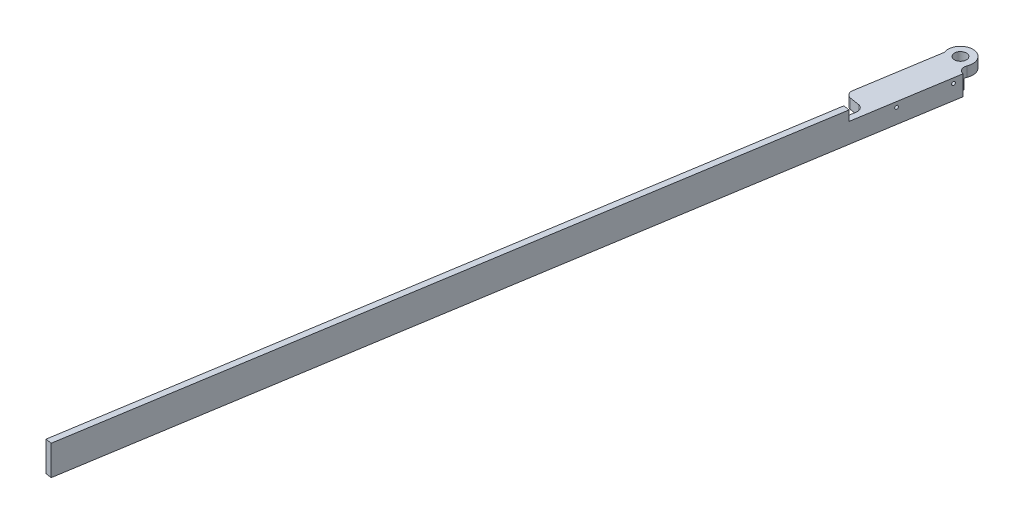
ISO-10303-21;
HEADER;
FILE_DESCRIPTION(('STEP AP214'),'2;1');
FILE_NAME('part.step','',(''),(''),'','','');
FILE_SCHEMA(('AUTOMOTIVE_DESIGN { 1 0 10303 214 1 1 1 1 }'));
ENDSEC;
DATA;
#1=APPLICATION_CONTEXT('core data for automotive mechanical design processes');
#2=APPLICATION_PROTOCOL_DEFINITION('international standard','automotive_design',2000,#1);
#3=PRODUCT_CONTEXT('',#1,'mechanical');
#4=PRODUCT('Part','Part','',(#3));
#5=PRODUCT_RELATED_PRODUCT_CATEGORY('part','',(#4));
#6=PRODUCT_DEFINITION_FORMATION('','',#4);
#7=PRODUCT_DEFINITION_CONTEXT('part definition',#1,'design');
#8=PRODUCT_DEFINITION('design','',#6,#7);
#9=PRODUCT_DEFINITION_SHAPE('','',#8);
#10=(LENGTH_UNIT() NAMED_UNIT(*) SI_UNIT(.MILLI.,.METRE.));
#11=(NAMED_UNIT(*) PLANE_ANGLE_UNIT() SI_UNIT($,.RADIAN.));
#12=(NAMED_UNIT(*) SI_UNIT($,.STERADIAN.) SOLID_ANGLE_UNIT());
#13=UNCERTAINTY_MEASURE_WITH_UNIT(LENGTH_MEASURE(1.E-05),#10,'distance_accuracy_value','');
#14=(GEOMETRIC_REPRESENTATION_CONTEXT(3) GLOBAL_UNCERTAINTY_ASSIGNED_CONTEXT((#13)) GLOBAL_UNIT_ASSIGNED_CONTEXT((#10,
#11,#12)) REPRESENTATION_CONTEXT('',''));
#15=CARTESIAN_POINT('',(0.,0.,0.));
#16=DIRECTION('',(0.,0.,1.));
#17=DIRECTION('',(1.,0.,0.));
#18=AXIS2_PLACEMENT_3D('',#15,#16,#17);
#19=CARTESIAN_POINT('',(-37.8700021982142,13.8264111663313,297.270264957212));
#20=DIRECTION('',(-0.987382807526428,0.,-0.158351480577954));
#21=DIRECTION('',(-0.158351480577954,0.,0.987382807526428));
#22=AXIS2_PLACEMENT_3D('',#19,#20,#21);
#23=PLANE('',#22);
#24=DIRECTION('',(0.158351480577954,0.,-0.987382807526428));
#25=VECTOR('',#24,1.);
#26=CARTESIAN_POINT('',(-13.737236558134,15.7314111663313,146.793125090185));
#27=LINE('',#26,#25);
#28=CARTESIAN_POINT('',(-19.7704279681541,15.7314111663313,184.412410056941));
#29=VERTEX_POINT('',#28);
#30=CARTESIAN_POINT('',(-19.1089041789644,15.7314111663313,180.287553037407));
#31=VERTEX_POINT('',#30);
#32=EDGE_CURVE('E179',#29,#31,#27,.T.);
#33=ORIENTED_EDGE('',*,*,#32,.T.);
#34=DIRECTION('',(0.,-1.,0.));
#35=VECTOR('',#34,1.);
#36=CARTESIAN_POINT('',(-19.1089041789644,13.8264111663313,180.287553037407));
#37=LINE('',#36,#35);
#38=CARTESIAN_POINT('',(-19.1089041789644,11.9214111663313,180.287553037407));
#39=VERTEX_POINT('',#38);
#40=EDGE_CURVE('E259',#31,#39,#37,.T.);
#41=ORIENTED_EDGE('',*,*,#40,.T.);
#42=DIRECTION('',(0.158351480577954,0.,-0.987382807526427));
#43=VECTOR('',#42,1.);
#44=CARTESIAN_POINT('',(-18.7066914182964,11.9214111663313,177.77960070629));
#45=LINE('',#44,#43);
#46=CARTESIAN_POINT('',(-13.4189862964671,11.9214111663313,144.808711457209));
#47=VERTEX_POINT('',#46);
#48=EDGE_CURVE('E67',#39,#47,#45,.T.);
#49=ORIENTED_EDGE('',*,*,#48,.T.);
#50=DIRECTION('',(0.,-1.,0.));
#51=VECTOR('',#50,1.);
#52=CARTESIAN_POINT('',(-13.4189862964671,11.9214111663313,144.808711457209));
#53=LINE('',#52,#51);
#54=CARTESIAN_POINT('',(-13.4189862964671,8.11141116633134,144.808711457209));
#55=VERTEX_POINT('',#54);
#56=EDGE_CURVE('E268',#47,#55,#53,.T.);
#57=ORIENTED_EDGE('',*,*,#56,.T.);
#58=DIRECTION('',(0.158351480577954,0.,-0.987382807526427));
#59=VECTOR('',#58,1.);
#60=CARTESIAN_POINT('',(-62.0027678382944,8.11141116633134,447.74740482424));
#61=LINE('',#60,#59);
#62=CARTESIAN_POINT('',(-62.0027678382944,8.11141116633134,447.74740482424));
#63=VERTEX_POINT('',#62);
#64=EDGE_CURVE('E60',#63,#55,#61,.T.);
#65=ORIENTED_EDGE('',*,*,#64,.F.);
#66=DIRECTION('',(0.,-1.,0.));
#67=VECTOR('',#66,1.);
#68=CARTESIAN_POINT('',(-62.0027678382944,8.11141116633134,447.74740482424));
#69=LINE('',#68,#67);
#70=CARTESIAN_POINT('',(-62.0027678382944,19.5414111663313,447.74740482424));
#71=VERTEX_POINT('',#70);
#72=EDGE_CURVE('E226',#71,#63,#69,.T.);
#73=ORIENTED_EDGE('',*,*,#72,.F.);
#74=DIRECTION('',(-0.158351480577954,0.,0.987382807526427));
#75=VECTOR('',#74,1.);
#76=CARTESIAN_POINT('',(-62.0027678382944,19.5414111663313,447.74740482424));
#77=LINE('',#76,#75);
#78=CARTESIAN_POINT('',(-19.7704279681541,19.5414111663313,184.412410056941));
#79=VERTEX_POINT('',#78);
#80=EDGE_CURVE('E196',#79,#71,#77,.T.);
#81=ORIENTED_EDGE('',*,*,#80,.F.);
#82=DIRECTION('',(0.,-1.,0.));
#83=VECTOR('',#82,1.);
#84=CARTESIAN_POINT('',(-19.7704279681541,19.5414111663313,184.412410056941));
#85=LINE('',#84,#83);
#86=EDGE_CURVE('E175',#79,#29,#85,.T.);
#87=ORIENTED_EDGE('',*,*,#86,.T.);
#88=EDGE_LOOP('',(#33,#41,#49,#57,#65,#73,#81,#87));
#89=FACE_BOUND('',#88,.T.);
#90=ADVANCED_FACE('F44',(#89),#23,.T.);
#91=CARTESIAN_POINT('',(-17.2565982139791,13.8264111663313,168.737707987459));
#92=DIRECTION('',(0.987382807526428,0.,0.158351480577954));
#93=DIRECTION('',(0.158351480577954,0.,-0.987382807526428));
#94=AXIS2_PLACEMENT_3D('',#91,#92,#93);
#95=CIRCLE('',#94,0.634999999999989);
#96=CARTESIAN_POINT('',(-17.1560450238121,13.8264111663313,168.11071990468));
#97=VERTEX_POINT('',#96);
#98=EDGE_CURVE('E202',#97,#97,#95,.T.);
#99=ORIENTED_EDGE('',*,*,#98,.T.);
#100=EDGE_LOOP('',(#99));
#101=FACE_BOUND('',#100,.T.);
#102=CARTESIAN_POINT('',(-17.256598213979,13.8264111663313,168.737707987459));
#103=DIRECTION('',(0.987382807526427,0.,0.158351480577954));
#104=DIRECTION('',(-0.158351480577954,0.,0.987382807526427));
#105=AXIS2_PLACEMENT_3D('',#102,#103,#104);
#106=CIRCLE('',#105,1.27);
#107=CARTESIAN_POINT('',(-17.457704594313,13.8264111663313,169.991684153017));
#108=VERTEX_POINT('',#107);
#109=EDGE_CURVE('E345',#108,#108,#106,.T.);
#110=ORIENTED_EDGE('',*,*,#109,.F.);
#111=EDGE_LOOP('',(#110));
#112=FACE_BOUND('',#111,.T.);
#113=ADVANCED_FACE('F326',(#101,#112),#23,.T.);
#114=CARTESIAN_POINT('',(-14.240002508969,13.8264111663313,149.928065504081));
#115=DIRECTION('',(0.987382807526428,0.,0.158351480577954));
#116=DIRECTION('',(0.158351480577954,0.,-0.987382807526428));
#117=AXIS2_PLACEMENT_3D('',#114,#115,#116);
#118=CIRCLE('',#117,0.634999999999989);
#119=CARTESIAN_POINT('',(-14.139449318802,13.8264111663313,149.301077421302));
#120=VERTEX_POINT('',#119);
#121=EDGE_CURVE('E164',#120,#120,#118,.T.);
#122=ORIENTED_EDGE('',*,*,#121,.T.);
#123=EDGE_LOOP('',(#122));
#124=FACE_BOUND('',#123,.T.);
#125=CARTESIAN_POINT('',(-14.2400025089689,13.8264111663313,149.92806550408));
#126=DIRECTION('',(0.987382807526427,0.,0.158351480577954));
#127=DIRECTION('',(-0.158351480577954,0.,0.987382807526427));
#128=AXIS2_PLACEMENT_3D('',#125,#126,#127);
#129=CIRCLE('',#128,1.27);
#130=CARTESIAN_POINT('',(-14.4411088893029,13.8264111663313,151.182041669639));
#131=VERTEX_POINT('',#130);
#132=EDGE_CURVE('E241',#131,#131,#129,.T.);
#133=ORIENTED_EDGE('',*,*,#132,.F.);
#134=EDGE_LOOP('',(#133));
#135=FACE_BOUND('',#134,.T.);
#136=ADVANCED_FACE('F327',(#124,#135),#23,.T.);
#137=CARTESIAN_POINT('',(-59.6515625278721,19.5414111663313,448.124479287366));
#138=DIRECTION('',(0.,-1.,0.));
#139=DIRECTION('',(-0.987382807526428,0.,-0.158351480577954));
#140=AXIS2_PLACEMENT_3D('',#137,#138,#139);
#141=PLANE('',#140);
#142=DIRECTION('',(-0.158351480577954,0.,0.987382807526427));
#143=VECTOR('',#142,1.);
#144=CARTESIAN_POINT('',(-59.6515625278721,19.5414111663313,448.124479287366));
#145=LINE('',#144,#143);
#146=CARTESIAN_POINT('',(-17.4192226577318,19.5414111663313,184.789484520068));
#147=VERTEX_POINT('',#146);
#148=CARTESIAN_POINT('',(-59.6515625278721,19.5414111663313,448.124479287366));
#149=VERTEX_POINT('',#148);
#150=EDGE_CURVE('E213',#147,#149,#145,.T.);
#151=ORIENTED_EDGE('',*,*,#150,.F.);
#152=DIRECTION('',(0.987382807526427,0.,0.158351480577954));
#153=VECTOR('',#152,1.);
#154=CARTESIAN_POINT('',(-19.7704279681541,19.5414111663313,184.412410056941));
#155=LINE('',#154,#153);
#156=EDGE_CURVE('E184',#79,#147,#155,.T.);
#157=ORIENTED_EDGE('',*,*,#156,.F.);
#158=ORIENTED_EDGE('',*,*,#80,.T.);
#159=DIRECTION('',(-0.987382807526427,0.,-0.158351480577954));
#160=VECTOR('',#159,1.);
#161=CARTESIAN_POINT('',(-59.6515625278721,19.5414111663313,448.124479287366));
#162=LINE('',#161,#160);
#163=EDGE_CURVE('E233',#149,#71,#162,.T.);
#164=ORIENTED_EDGE('',*,*,#163,.F.);
#165=EDGE_LOOP('',(#151,#157,#158,#164));
#166=FACE_BOUND('',#165,.T.);
#167=ADVANCED_FACE('F296',(#166),#141,.F.);
#168=CARTESIAN_POINT('',(-59.6515625278721,8.11141116633134,448.124479287366));
#169=DIRECTION('',(0.158351480577954,0.,-0.987382807526427));
#170=DIRECTION('',(-0.987382807526428,0.,-0.158351480577954));
#171=AXIS2_PLACEMENT_3D('',#168,#169,#170);
#172=PLANE('',#171);
#173=ORIENTED_EDGE('',*,*,#72,.T.);
#174=DIRECTION('',(-0.987382807526427,0.,-0.158351480577954));
#175=VECTOR('',#174,1.);
#176=CARTESIAN_POINT('',(-59.6515625278721,8.11141116633134,448.124479287366));
#177=LINE('',#176,#175);
#178=CARTESIAN_POINT('',(-59.6515625278721,8.11141116633134,448.124479287366));
#179=VERTEX_POINT('',#178);
#180=EDGE_CURVE('E223',#179,#63,#177,.T.);
#181=ORIENTED_EDGE('',*,*,#180,.F.);
#182=DIRECTION('',(0.,-1.,0.));
#183=VECTOR('',#182,1.);
#184=CARTESIAN_POINT('',(-59.6515625278721,8.11141116633134,448.124479287366));
#185=LINE('',#184,#183);
#186=EDGE_CURVE('E216',#149,#179,#185,.T.);
#187=ORIENTED_EDGE('',*,*,#186,.F.);
#188=ORIENTED_EDGE('',*,*,#163,.T.);
#189=EDGE_LOOP('',(#173,#181,#187,#188));
#190=FACE_BOUND('',#189,.T.);
#191=ADVANCED_FACE('F311',(#190),#172,.F.);
#192=CARTESIAN_POINT('',(-59.6515625278721,8.11141116633134,448.124479287366));
#193=DIRECTION('',(0.,1.,0.));
#194=DIRECTION('',(0.987382807526428,0.,0.158351480577954));
#195=AXIS2_PLACEMENT_3D('',#192,#193,#194);
#196=PLANE('',#195);
#197=ORIENTED_EDGE('',*,*,#64,.T.);
#198=CARTESIAN_POINT('',(-10.8822157630501,8.11141116633134,144.680667477314));
#199=DIRECTION('',(0.,1.,0.));
#200=DIRECTION('',(0.,0.,1.));
#201=AXIS2_PLACEMENT_3D('',#198,#199,#200);
#202=CIRCLE('',#201,2.54);
#203=CARTESIAN_POINT('',(-11.3860312477117,8.11141116633134,147.170199553311));
#204=VERTEX_POINT('',#203);
#205=EDGE_CURVE('E271',#55,#204,#202,.T.);
#206=ORIENTED_EDGE('',*,*,#205,.T.);
#207=DIRECTION('',(0.158351480577954,0.,-0.987382807526427));
#208=VECTOR('',#207,1.);
#209=CARTESIAN_POINT('',(-59.6515625278721,8.11141116633134,448.124479287366));
#210=LINE('',#209,#208);
#211=EDGE_CURVE('E219',#179,#204,#210,.T.);
#212=ORIENTED_EDGE('',*,*,#211,.F.);
#213=ORIENTED_EDGE('',*,*,#180,.T.);
#214=EDGE_LOOP('',(#197,#206,#212,#213));
#215=FACE_BOUND('',#214,.T.);
#216=ADVANCED_FACE('F313',(#215),#196,.F.);
#217=CARTESIAN_POINT('',(-35.5187968877919,13.8264111663313,297.647339420338));
#218=DIRECTION('',(-0.987382807526428,0.,-0.158351480577954));
#219=DIRECTION('',(-0.158351480577954,0.,0.987382807526428));
#220=AXIS2_PLACEMENT_3D('',#217,#218,#219);
#221=PLANE('',#220);
#222=CARTESIAN_POINT('',(-14.9053929035568,13.8264111663313,169.114782450586));
#223=DIRECTION('',(0.987382807526428,0.,0.158351480577954));
#224=DIRECTION('',(0.158351480577954,0.,-0.987382807526428));
#225=AXIS2_PLACEMENT_3D('',#222,#223,#224);
#226=CIRCLE('',#225,0.634999999999989);
#227=CARTESIAN_POINT('',(-14.8048397133898,13.8264111663313,168.487794367806));
#228=VERTEX_POINT('',#227);
#229=EDGE_CURVE('E189',#228,#228,#226,.T.);
#230=ORIENTED_EDGE('',*,*,#229,.F.);
#231=EDGE_LOOP('',(#230));
#232=FACE_BOUND('',#231,.T.);
#233=CARTESIAN_POINT('',(-11.8887971985467,13.8264111663313,150.305139967207));
#234=DIRECTION('',(0.987382807526428,0.,0.158351480577954));
#235=DIRECTION('',(0.158351480577954,0.,-0.987382807526428));
#236=AXIS2_PLACEMENT_3D('',#233,#234,#235);
#237=CIRCLE('',#236,0.634999999999989);
#238=CARTESIAN_POINT('',(-11.7882440083797,13.8264111663313,149.678151884428));
#239=VERTEX_POINT('',#238);
#240=EDGE_CURVE('E169',#239,#239,#237,.T.);
#241=ORIENTED_EDGE('',*,*,#240,.F.);
#242=EDGE_LOOP('',(#241));
#243=FACE_BOUND('',#242,.T.);
#244=DIRECTION('',(0.,1.,0.));
#245=VECTOR('',#244,1.);
#246=CARTESIAN_POINT('',(-11.3860312477117,8.11141116633134,147.170199553311));
#247=LINE('',#246,#245);
#248=CARTESIAN_POINT('',(-11.3860312477117,15.7314111663313,147.170199553311));
#249=VERTEX_POINT('',#248);
#250=EDGE_CURVE('E209',#204,#249,#247,.T.);
#251=ORIENTED_EDGE('',*,*,#250,.T.);
#252=DIRECTION('',(0.158351480577954,0.,-0.987382807526428));
#253=VECTOR('',#252,1.);
#254=CARTESIAN_POINT('',(-11.3860312477117,15.7314111663313,147.170199553311));
#255=LINE('',#254,#253);
#256=CARTESIAN_POINT('',(-17.4192226577318,15.7314111663313,184.789484520068));
#257=VERTEX_POINT('',#256);
#258=EDGE_CURVE('E180',#257,#249,#255,.T.);
#259=ORIENTED_EDGE('',*,*,#258,.F.);
#260=DIRECTION('',(0.,-1.,0.));
#261=VECTOR('',#260,1.);
#262=CARTESIAN_POINT('',(-17.4192226577318,19.5414111663313,184.789484520068));
#263=LINE('',#262,#261);
#264=EDGE_CURVE('E185',#147,#257,#263,.T.);
#265=ORIENTED_EDGE('',*,*,#264,.F.);
#266=ORIENTED_EDGE('',*,*,#150,.T.);
#267=ORIENTED_EDGE('',*,*,#186,.T.);
#268=ORIENTED_EDGE('',*,*,#211,.T.);
#269=EDGE_LOOP('',(#251,#259,#265,#266,#267,#268));
#270=FACE_BOUND('',#269,.T.);
#271=ADVANCED_FACE('F300',(#232,#243,#270),#221,.F.);
#272=CARTESIAN_POINT('',(-14.240002508969,13.8264111663313,149.928065504081));
#273=DIRECTION('',(0.987382807526427,0.,0.158351480577954));
#274=DIRECTION('',(0.158351480577954,0.,-0.987382807526428));
#275=AXIS2_PLACEMENT_3D('',#272,#273,#274);
#276=CYLINDRICAL_SURFACE('',#275,0.634999999999989);
#277=ORIENTED_EDGE('',*,*,#121,.F.);
#278=EDGE_LOOP('',(#277));
#279=FACE_BOUND('',#278,.T.);
#280=ORIENTED_EDGE('',*,*,#240,.T.);
#281=EDGE_LOOP('',(#280));
#282=FACE_BOUND('',#281,.T.);
#283=ADVANCED_FACE('F320',(#279,#282),#276,.F.);
#284=CARTESIAN_POINT('',(-17.2565982139791,13.8264111663313,168.737707987459));
#285=DIRECTION('',(0.987382807526427,0.,0.158351480577954));
#286=DIRECTION('',(0.158351480577954,0.,-0.987382807526428));
#287=AXIS2_PLACEMENT_3D('',#284,#285,#286);
#288=CYLINDRICAL_SURFACE('',#287,0.634999999999989);
#289=ORIENTED_EDGE('',*,*,#98,.F.);
#290=EDGE_LOOP('',(#289));
#291=FACE_BOUND('',#290,.T.);
#292=ORIENTED_EDGE('',*,*,#229,.T.);
#293=EDGE_LOOP('',(#292));
#294=FACE_BOUND('',#293,.T.);
#295=ADVANCED_FACE('F408',(#291,#294),#288,.F.);
#296=CARTESIAN_POINT('',(-13.737236558134,15.7314111663313,146.793125090185));
#297=DIRECTION('',(0.,-1.,0.));
#298=DIRECTION('',(0.158351480577954,0.,-0.987382807526428));
#299=AXIS2_PLACEMENT_3D('',#296,#297,#298);
#300=PLANE('',#299);
#301=CARTESIAN_POINT('',(-17.640082657048,15.7314111663313,141.913405058785));
#302=DIRECTION('',(0.,1.,0.));
#303=DIRECTION('',(0.,0.,1.));
#304=AXIS2_PLACEMENT_3D('',#301,#302,#303);
#305=CIRCLE('',#304,2.286);
#306=CARTESIAN_POINT('',(-17.640082657048,15.7314111663313,144.199405058785));
#307=VERTEX_POINT('',#306);
#308=EDGE_CURVE('E242',#307,#307,#305,.T.);
#309=ORIENTED_EDGE('',*,*,#308,.F.);
#310=EDGE_LOOP('',(#309));
#311=FACE_BOUND('',#310,.T.);
#312=DIRECTION('',(0.158351480577954,0.,-0.987382807526427));
#313=VECTOR('',#312,1.);
#314=CARTESIAN_POINT('',(-21.6932258595589,15.7314111663313,141.2633823703));
#315=LINE('',#314,#313);
#316=CARTESIAN_POINT('',(-26.9255647958436,15.7314111663313,173.889042010377));
#317=VERTEX_POINT('',#316);
#318=CARTESIAN_POINT('',(-22.075601469951,15.7314111663313,143.647642386945));
#319=VERTEX_POINT('',#318);
#320=EDGE_CURVE('E161',#317,#319,#315,.T.);
#321=ORIENTED_EDGE('',*,*,#320,.F.);
#322=CARTESIAN_POINT('',(-24.4176124647264,15.7314111663313,174.291254771045));
#323=DIRECTION('',(0.,-1.,0.));
#324=DIRECTION('',(0.,0.,-1.));
#325=AXIS2_PLACEMENT_3D('',#322,#323,#324);
#326=CIRCLE('',#325,2.54);
#327=CARTESIAN_POINT('',(-24.8198252253944,15.7314111663313,176.799207102162));
#328=VERTEX_POINT('',#327);
#329=EDGE_CURVE('E248',#317,#328,#326,.F.);
#330=ORIENTED_EDGE('',*,*,#329,.T.);
#331=DIRECTION('',(-0.987382807526427,0.,-0.158351480577954));
#332=VECTOR('',#331,1.);
#333=CARTESIAN_POINT('',(-23.2746343540006,15.7314111663313,177.047017029979));
#334=LINE('',#333,#332);
#335=CARTESIAN_POINT('',(-21.2146437494136,15.7314111663313,177.377387945622));
#336=VERTEX_POINT('',#335);
#337=EDGE_CURVE('E147',#336,#328,#334,.T.);
#338=ORIENTED_EDGE('',*,*,#337,.F.);
#339=CARTESIAN_POINT('',(-21.6168565100816,15.7314111663313,179.885340276739));
#340=DIRECTION('',(0.,-1.,0.));
#341=DIRECTION('',(0.,0.,-1.));
#342=AXIS2_PLACEMENT_3D('',#339,#340,#341);
#343=CIRCLE('',#342,2.54);
#344=EDGE_CURVE('E11',#336,#31,#343,.T.);
#345=ORIENTED_EDGE('',*,*,#344,.T.);
#346=ORIENTED_EDGE('',*,*,#32,.F.);
#347=DIRECTION('',(0.987382807526427,0.,0.158351480577954));
#348=VECTOR('',#347,1.);
#349=CARTESIAN_POINT('',(-19.7704279681541,15.7314111663313,184.412410056941));
#350=LINE('',#349,#348);
#351=EDGE_CURVE('E193',#29,#257,#350,.T.);
#352=ORIENTED_EDGE('',*,*,#351,.T.);
#353=ORIENTED_EDGE('',*,*,#258,.T.);
#354=CARTESIAN_POINT('',(-10.8822157630501,15.7314111663313,144.680667477314));
#355=DIRECTION('',(0.,-1.,0.));
#356=DIRECTION('',(0.,0.,-1.));
#357=AXIS2_PLACEMENT_3D('',#354,#355,#356);
#358=CIRCLE('',#357,2.54);
#359=CARTESIAN_POINT('',(-13.2327781609624,15.7314111663313,143.718141418695));
#360=VERTEX_POINT('',#359);
#361=EDGE_CURVE('E262',#249,#360,#358,.T.);
#362=ORIENTED_EDGE('',*,*,#361,.T.);
#363=CARTESIAN_POINT('',(-17.640082657048,15.7314111663313,141.913405058785));
#364=DIRECTION('',(0.,-1.,0.));
#365=DIRECTION('',(-0.158351480577954,0.,0.987382807526427));
#366=AXIS2_PLACEMENT_3D('',#363,#364,#365);
#367=CIRCLE('',#366,4.7625);
#368=EDGE_CURVE('E304',#319,#360,#367,.T.);
#369=ORIENTED_EDGE('',*,*,#368,.F.);
#370=EDGE_LOOP('',(#321,#330,#338,#345,#346,#352,#353,#362,#369));
#371=FACE_BOUND('',#370,.T.);
#372=ADVANCED_FACE('F286',(#311,#371),#300,.F.);
#373=CARTESIAN_POINT('',(-19.7704279681541,19.5414111663313,184.412410056941));
#374=DIRECTION('',(-0.158351480577954,0.,0.987382807526427));
#375=DIRECTION('',(0.987382807526428,0.,0.158351480577954));
#376=AXIS2_PLACEMENT_3D('',#373,#374,#375);
#377=PLANE('',#376);
#378=ORIENTED_EDGE('',*,*,#264,.T.);
#379=ORIENTED_EDGE('',*,*,#351,.F.);
#380=ORIENTED_EDGE('',*,*,#86,.F.);
#381=ORIENTED_EDGE('',*,*,#156,.T.);
#382=EDGE_LOOP('',(#378,#379,#380,#381));
#383=FACE_BOUND('',#382,.T.);
#384=ADVANCED_FACE('F292',(#383),#377,.F.);
#385=CARTESIAN_POINT('',(-19.7261482332877,13.8264111663313,149.048225090119));
#386=DIRECTION('',(0.987382807526427,0.,0.158351480577954));
#387=DIRECTION('',(-0.158351480577954,0.,0.987382807526427));
#388=AXIS2_PLACEMENT_3D('',#385,#386,#387);
#389=PLANE('',#388);
#390=CARTESIAN_POINT('',(-19.7261482332877,13.8264111663313,149.048225090119));
#391=DIRECTION('',(0.987382807526427,0.,0.158351480577954));
#392=DIRECTION('',(-0.158351480577954,0.,0.987382807526427));
#393=AXIS2_PLACEMENT_3D('',#390,#391,#392);
#394=CIRCLE('',#393,1.27);
#395=CARTESIAN_POINT('',(-19.9272546136217,13.8264111663313,150.302201255678));
#396=VERTEX_POINT('',#395);
#397=EDGE_CURVE('E355',#396,#396,#394,.T.);
#398=ORIENTED_EDGE('',*,*,#397,.T.);
#399=EDGE_LOOP('',(#398));
#400=FACE_BOUND('',#399,.T.);
#401=ADVANCED_FACE('F384',(#400),#389,.T.);
#402=CARTESIAN_POINT('',(-19.7261482332877,13.8264111663313,149.048225090119));
#403=DIRECTION('',(0.987382807526427,0.,0.158351480577954));
#404=DIRECTION('',(-0.158351480577954,0.,0.987382807526427));
#405=AXIS2_PLACEMENT_3D('',#402,#403,#404);
#406=CYLINDRICAL_SURFACE('',#405,1.27);
#407=ORIENTED_EDGE('',*,*,#397,.F.);
#408=EDGE_LOOP('',(#407));
#409=FACE_BOUND('',#408,.T.);
#410=ORIENTED_EDGE('',*,*,#132,.T.);
#411=EDGE_LOOP('',(#410));
#412=FACE_BOUND('',#411,.T.);
#413=ADVANCED_FACE('F387',(#409,#412),#406,.F.);
#414=CARTESIAN_POINT('',(-22.7427439382977,13.8264111663313,167.857867573497));
#415=DIRECTION('',(0.987382807526427,0.,0.158351480577954));
#416=DIRECTION('',(-0.158351480577954,0.,0.987382807526427));
#417=AXIS2_PLACEMENT_3D('',#414,#415,#416);
#418=PLANE('',#417);
#419=CARTESIAN_POINT('',(-22.7427439382977,13.8264111663313,167.857867573497));
#420=DIRECTION('',(0.987382807526427,0.,0.158351480577954));
#421=DIRECTION('',(-0.158351480577954,0.,0.987382807526427));
#422=AXIS2_PLACEMENT_3D('',#419,#420,#421);
#423=CIRCLE('',#422,1.27);
#424=CARTESIAN_POINT('',(-22.9438503186317,13.8264111663313,169.111843739056));
#425=VERTEX_POINT('',#424);
#426=EDGE_CURVE('E354',#425,#425,#423,.T.);
#427=ORIENTED_EDGE('',*,*,#426,.T.);
#428=EDGE_LOOP('',(#427));
#429=FACE_BOUND('',#428,.T.);
#430=ADVANCED_FACE('F391',(#429),#418,.T.);
#431=CARTESIAN_POINT('',(-22.7427439382977,13.8264111663313,167.857867573497));
#432=DIRECTION('',(0.987382807526427,0.,0.158351480577954));
#433=DIRECTION('',(-0.158351480577954,0.,0.987382807526427));
#434=AXIS2_PLACEMENT_3D('',#431,#432,#433);
#435=CYLINDRICAL_SURFACE('',#434,1.27);
#436=ORIENTED_EDGE('',*,*,#426,.F.);
#437=EDGE_LOOP('',(#436));
#438=FACE_BOUND('',#437,.T.);
#439=ORIENTED_EDGE('',*,*,#109,.T.);
#440=EDGE_LOOP('',(#439));
#441=FACE_BOUND('',#440,.T.);
#442=ADVANCED_FACE('F393',(#438,#441),#435,.F.);
#443=CARTESIAN_POINT('',(-21.6932258595589,11.9214111663313,141.2633823703));
#444=DIRECTION('',(0.987382807526427,0.,0.158351480577954));
#445=DIRECTION('',(-0.158351480577954,0.,0.987382807526427));
#446=AXIS2_PLACEMENT_3D('',#443,#444,#445);
#447=PLANE('',#446);
#448=DIRECTION('',(0.158351480577954,0.,-0.987382807526427));
#449=VECTOR('',#448,1.);
#450=CARTESIAN_POINT('',(-21.6932258595589,11.9214111663313,141.2633823703));
#451=LINE('',#450,#449);
#452=CARTESIAN_POINT('',(-26.9255647958436,11.9214111663313,173.889042010377));
#453=VERTEX_POINT('',#452);
#454=CARTESIAN_POINT('',(-22.075601469951,11.9214111663313,143.647642386945));
#455=VERTEX_POINT('',#454);
#456=EDGE_CURVE('E134',#453,#455,#451,.T.);
#457=ORIENTED_EDGE('',*,*,#456,.F.);
#458=DIRECTION('',(0.,1.,0.));
#459=VECTOR('',#458,1.);
#460=CARTESIAN_POINT('',(-26.9255647958435,11.9214111663313,173.889042010377));
#461=LINE('',#460,#459);
#462=EDGE_CURVE('E245',#453,#317,#461,.T.);
#463=ORIENTED_EDGE('',*,*,#462,.T.);
#464=ORIENTED_EDGE('',*,*,#320,.T.);
#465=DIRECTION('',(0.,1.,0.));
#466=VECTOR('',#465,1.);
#467=CARTESIAN_POINT('',(-22.075601469951,11.9214111663313,143.647642386945));
#468=LINE('',#467,#466);
#469=EDGE_CURVE('E153',#455,#319,#468,.T.);
#470=ORIENTED_EDGE('',*,*,#469,.F.);
#471=EDGE_LOOP('',(#457,#463,#464,#470));
#472=FACE_BOUND('',#471,.T.);
#473=ADVANCED_FACE('F159',(#472),#447,.F.);
#474=CARTESIAN_POINT('',(-17.640082657048,11.9214111663313,141.913405058785));
#475=DIRECTION('',(0.,1.,0.));
#476=DIRECTION('',(0.158351480577954,0.,-0.987382807526427));
#477=AXIS2_PLACEMENT_3D('',#474,#475,#476);
#478=CYLINDRICAL_SURFACE('',#477,4.7625);
#479=ORIENTED_EDGE('',*,*,#368,.T.);
#480=DIRECTION('',(0.,1.,0.));
#481=VECTOR('',#480,1.);
#482=CARTESIAN_POINT('',(-13.2327781609624,11.9214111663313,143.718141418695));
#483=LINE('',#482,#481);
#484=CARTESIAN_POINT('',(-13.2327781609624,11.9214111663313,143.718141418695));
#485=VERTEX_POINT('',#484);
#486=EDGE_CURVE('E155',#360,#485,#483,.F.);
#487=ORIENTED_EDGE('',*,*,#486,.T.);
#488=CARTESIAN_POINT('',(-17.640082657048,11.9214111663313,141.913405058785));
#489=DIRECTION('',(0.,-1.,0.));
#490=DIRECTION('',(-0.158351480577954,0.,0.987382807526427));
#491=AXIS2_PLACEMENT_3D('',#488,#489,#490);
#492=CIRCLE('',#491,4.7625);
#493=EDGE_CURVE('E138',#455,#485,#492,.T.);
#494=ORIENTED_EDGE('',*,*,#493,.F.);
#495=ORIENTED_EDGE('',*,*,#469,.T.);
#496=EDGE_LOOP('',(#479,#487,#494,#495));
#497=FACE_BOUND('',#496,.T.);
#498=ADVANCED_FACE('F152',(#497),#478,.T.);
#499=CARTESIAN_POINT('',(-23.2746343540006,11.9214111663313,177.047017029979));
#500=DIRECTION('',(0.158351480577954,0.,-0.987382807526427));
#501=DIRECTION('',(0.987382807526427,0.,0.158351480577954));
#502=AXIS2_PLACEMENT_3D('',#499,#500,#501);
#503=PLANE('',#502);
#504=ORIENTED_EDGE('',*,*,#337,.T.);
#505=DIRECTION('',(0.,1.,0.));
#506=VECTOR('',#505,1.);
#507=CARTESIAN_POINT('',(-24.8198252253944,11.9214111663313,176.799207102162));
#508=LINE('',#507,#506);
#509=CARTESIAN_POINT('',(-24.8198252253944,11.9214111663313,176.799207102162));
#510=VERTEX_POINT('',#509);
#511=EDGE_CURVE('E254',#328,#510,#508,.F.);
#512=ORIENTED_EDGE('',*,*,#511,.T.);
#513=DIRECTION('',(-0.987382807526427,0.,-0.158351480577954));
#514=VECTOR('',#513,1.);
#515=CARTESIAN_POINT('',(-23.2746343540006,11.9214111663313,177.047017029979));
#516=LINE('',#515,#514);
#517=CARTESIAN_POINT('',(-21.2146437494136,11.9214111663313,177.377387945622));
#518=VERTEX_POINT('',#517);
#519=EDGE_CURVE('E157',#518,#510,#516,.T.);
#520=ORIENTED_EDGE('',*,*,#519,.F.);
#521=DIRECTION('',(0.,-1.,0.));
#522=VECTOR('',#521,1.);
#523=CARTESIAN_POINT('',(-21.2146437494136,11.9214111663313,177.377387945622));
#524=LINE('',#523,#522);
#525=EDGE_CURVE('E251',#518,#336,#524,.F.);
#526=ORIENTED_EDGE('',*,*,#525,.T.);
#527=EDGE_LOOP('',(#504,#512,#520,#526));
#528=FACE_BOUND('',#527,.T.);
#529=ADVANCED_FACE('F281',(#528),#503,.F.);
#530=CARTESIAN_POINT('',(-17.640082657048,11.9214111663313,141.913405058785));
#531=DIRECTION('',(0.,-1.,0.));
#532=DIRECTION('',(-0.158351480577954,0.,0.987382807526427));
#533=AXIS2_PLACEMENT_3D('',#530,#531,#532);
#534=PLANE('',#533);
#535=CARTESIAN_POINT('',(-17.640082657048,11.9214111663313,141.913405058785));
#536=DIRECTION('',(0.,-1.,0.));
#537=DIRECTION('',(1.,0.,0.));
#538=AXIS2_PLACEMENT_3D('',#535,#536,#537);
#539=CIRCLE('',#538,2.286);
#540=CARTESIAN_POINT('',(-15.354082657048,11.9214111663313,141.913405058785));
#541=VERTEX_POINT('',#540);
#542=EDGE_CURVE('E237',#541,#541,#539,.T.);
#543=ORIENTED_EDGE('',*,*,#542,.F.);
#544=EDGE_LOOP('',(#543));
#545=FACE_BOUND('',#544,.T.);
#546=ORIENTED_EDGE('',*,*,#519,.T.);
#547=CARTESIAN_POINT('',(-24.4176124647264,11.9214111663313,174.291254771045));
#548=DIRECTION('',(0.,-1.,0.));
#549=DIRECTION('',(1.,0.,0.));
#550=AXIS2_PLACEMENT_3D('',#547,#548,#549);
#551=CIRCLE('',#550,2.54);
#552=EDGE_CURVE('E141',#510,#453,#551,.T.);
#553=ORIENTED_EDGE('',*,*,#552,.T.);
#554=ORIENTED_EDGE('',*,*,#456,.T.);
#555=ORIENTED_EDGE('',*,*,#493,.T.);
#556=CARTESIAN_POINT('',(-10.8822157630501,11.9214111663313,144.680667477314));
#557=DIRECTION('',(0.,-1.,0.));
#558=DIRECTION('',(1.,0.,0.));
#559=AXIS2_PLACEMENT_3D('',#556,#557,#558);
#560=CIRCLE('',#559,2.54);
#561=EDGE_CURVE('E265',#485,#47,#560,.F.);
#562=ORIENTED_EDGE('',*,*,#561,.T.);
#563=ORIENTED_EDGE('',*,*,#48,.F.);
#564=CARTESIAN_POINT('',(-21.6168565100816,11.9214111663313,179.885340276739));
#565=DIRECTION('',(0.,-1.,0.));
#566=DIRECTION('',(1.,0.,0.));
#567=AXIS2_PLACEMENT_3D('',#564,#565,#566);
#568=CIRCLE('',#567,2.54);
#569=EDGE_CURVE('E53',#39,#518,#568,.F.);
#570=ORIENTED_EDGE('',*,*,#569,.T.);
#571=EDGE_LOOP('',(#546,#553,#554,#555,#562,#563,#570));
#572=FACE_BOUND('',#571,.T.);
#573=ADVANCED_FACE('F137',(#545,#572),#534,.T.);
#574=CARTESIAN_POINT('',(-17.640082657048,8.11141116633134,141.913405058785));
#575=DIRECTION('',(0.,1.,0.));
#576=DIRECTION('',(0.,0.,1.));
#577=AXIS2_PLACEMENT_3D('',#574,#575,#576);
#578=CYLINDRICAL_SURFACE('',#577,2.286);
#579=ORIENTED_EDGE('',*,*,#542,.T.);
#580=EDGE_LOOP('',(#579));
#581=FACE_BOUND('',#580,.T.);
#582=ORIENTED_EDGE('',*,*,#308,.T.);
#583=EDGE_LOOP('',(#582));
#584=FACE_BOUND('',#583,.T.);
#585=ADVANCED_FACE('F371',(#581,#584),#578,.F.);
#586=CARTESIAN_POINT('',(-10.8822157630501,11.9214111663313,144.680667477314));
#587=DIRECTION('',(0.,-1.,0.));
#588=DIRECTION('',(0.,0.,-1.));
#589=AXIS2_PLACEMENT_3D('',#586,#587,#588);
#590=CYLINDRICAL_SURFACE('',#589,2.54);
#591=ORIENTED_EDGE('',*,*,#561,.F.);
#592=ORIENTED_EDGE('',*,*,#486,.F.);
#593=ORIENTED_EDGE('',*,*,#361,.F.);
#594=ORIENTED_EDGE('',*,*,#250,.F.);
#595=ORIENTED_EDGE('',*,*,#205,.F.);
#596=ORIENTED_EDGE('',*,*,#56,.F.);
#597=EDGE_LOOP('',(#591,#592,#593,#594,#595,#596));
#598=FACE_BOUND('',#597,.T.);
#599=ADVANCED_FACE('F307',(#598),#590,.F.);
#600=CARTESIAN_POINT('',(-24.4176124647264,11.9214111663313,174.291254771045));
#601=DIRECTION('',(0.,1.,0.));
#602=DIRECTION('',(-1.,0.,0.));
#603=AXIS2_PLACEMENT_3D('',#600,#601,#602);
#604=CYLINDRICAL_SURFACE('',#603,2.54);
#605=ORIENTED_EDGE('',*,*,#552,.F.);
#606=ORIENTED_EDGE('',*,*,#511,.F.);
#607=ORIENTED_EDGE('',*,*,#329,.F.);
#608=ORIENTED_EDGE('',*,*,#462,.F.);
#609=EDGE_LOOP('',(#605,#606,#607,#608));
#610=FACE_BOUND('',#609,.T.);
#611=ADVANCED_FACE('F365',(#610),#604,.T.);
#612=CARTESIAN_POINT('',(-21.6168565100816,13.8264111663313,179.885340276739));
#613=DIRECTION('',(0.,-1.,0.));
#614=DIRECTION('',(0.,0.,-1.));
#615=AXIS2_PLACEMENT_3D('',#612,#613,#614);
#616=CYLINDRICAL_SURFACE('',#615,2.54);
#617=ORIENTED_EDGE('',*,*,#344,.F.);
#618=ORIENTED_EDGE('',*,*,#525,.F.);
#619=ORIENTED_EDGE('',*,*,#569,.F.);
#620=ORIENTED_EDGE('',*,*,#40,.F.);
#621=EDGE_LOOP('',(#617,#618,#619,#620));
#622=FACE_BOUND('',#621,.T.);
#623=ADVANCED_FACE('F46',(#622),#616,.F.);
#624=CLOSED_SHELL('',(#90,#113,#136,#167,#191,#216,#271,#283,#295,#372,#384,#401,#413,#430,#442,
#473,#498,#529,#573,#585,#599,#611,#623));
#625=MANIFOLD_SOLID_BREP('B2',#624);
#626=ADVANCED_BREP_SHAPE_REPRESENTATION('',(#18,#625),#14);
#627=SHAPE_DEFINITION_REPRESENTATION(#9,#626);
ENDSEC;
END-ISO-10303-21;
